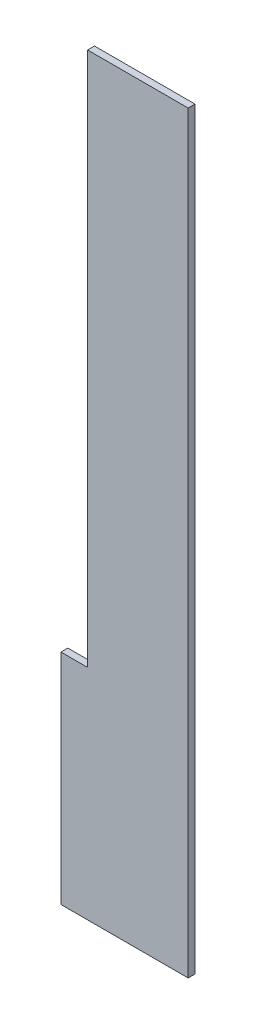
ISO-10303-21;
HEADER;
FILE_DESCRIPTION(('STEP AP214'),'2;1');
FILE_NAME('part.step','',(''),(''),'','','');
FILE_SCHEMA(('AUTOMOTIVE_DESIGN { 1 0 10303 214 1 1 1 1 }'));
ENDSEC;
DATA;
#1=APPLICATION_CONTEXT('core data for automotive mechanical design processes');
#2=APPLICATION_PROTOCOL_DEFINITION('international standard','automotive_design',2000,#1);
#3=PRODUCT_CONTEXT('',#1,'mechanical');
#4=PRODUCT('Part','Part','',(#3));
#5=PRODUCT_RELATED_PRODUCT_CATEGORY('part','',(#4));
#6=PRODUCT_DEFINITION_FORMATION('','',#4);
#7=PRODUCT_DEFINITION_CONTEXT('part definition',#1,'design');
#8=PRODUCT_DEFINITION('design','',#6,#7);
#9=PRODUCT_DEFINITION_SHAPE('','',#8);
#10=(LENGTH_UNIT() NAMED_UNIT(*) SI_UNIT(.MILLI.,.METRE.));
#11=(NAMED_UNIT(*) PLANE_ANGLE_UNIT() SI_UNIT($,.RADIAN.));
#12=(NAMED_UNIT(*) SI_UNIT($,.STERADIAN.) SOLID_ANGLE_UNIT());
#13=UNCERTAINTY_MEASURE_WITH_UNIT(LENGTH_MEASURE(1.E-05),#10,'distance_accuracy_value','');
#14=(GEOMETRIC_REPRESENTATION_CONTEXT(3) GLOBAL_UNCERTAINTY_ASSIGNED_CONTEXT((#13)) GLOBAL_UNIT_ASSIGNED_CONTEXT((#10,
#11,#12)) REPRESENTATION_CONTEXT('',''));
#15=CARTESIAN_POINT('',(0.,0.,0.));
#16=DIRECTION('',(0.,0.,1.));
#17=DIRECTION('',(1.,0.,0.));
#18=AXIS2_PLACEMENT_3D('',#15,#16,#17);
#19=CARTESIAN_POINT('',(4.24340115904558E-13,-3465.,-40.));
#20=DIRECTION('',(0.,1.,0.));
#21=DIRECTION('',(0.,0.,1.));
#22=AXIS2_PLACEMENT_3D('',#19,#20,#21);
#23=PLANE('',#22);
#24=DIRECTION('',(0.,0.,1.));
#25=VECTOR('',#24,1.);
#26=CARTESIAN_POINT('',(615.,-3465.,-40.));
#27=LINE('',#26,#25);
#28=CARTESIAN_POINT('',(615.,-3465.,-40.));
#29=VERTEX_POINT('',#28);
#30=CARTESIAN_POINT('',(615.,-3465.,0.));
#31=VERTEX_POINT('',#30);
#32=EDGE_CURVE('E96',#29,#31,#27,.T.);
#33=ORIENTED_EDGE('',*,*,#32,.T.);
#34=DIRECTION('',(-1.,0.,0.));
#35=VECTOR('',#34,1.);
#36=CARTESIAN_POINT('',(4.24340115904558E-13,-3465.,0.));
#37=LINE('',#36,#35);
#38=CARTESIAN_POINT('',(770.000000000001,-3465.,0.));
#39=VERTEX_POINT('',#38);
#40=EDGE_CURVE('E130',#39,#31,#37,.T.);
#41=ORIENTED_EDGE('',*,*,#40,.F.);
#42=DIRECTION('',(0.,0.,1.));
#43=VECTOR('',#42,1.);
#44=CARTESIAN_POINT('',(770.000000000001,-3465.,-40.));
#45=LINE('',#44,#43);
#46=CARTESIAN_POINT('',(770.000000000001,-3465.,-40.));
#47=VERTEX_POINT('',#46);
#48=EDGE_CURVE('E115',#47,#39,#45,.T.);
#49=ORIENTED_EDGE('',*,*,#48,.F.);
#50=DIRECTION('',(-1.,0.,0.));
#51=VECTOR('',#50,1.);
#52=CARTESIAN_POINT('',(4.24340115904558E-13,-3465.,-40.));
#53=LINE('',#52,#51);
#54=EDGE_CURVE('E131',#47,#29,#53,.T.);
#55=ORIENTED_EDGE('',*,*,#54,.T.);
#56=EDGE_LOOP('',(#33,#41,#49,#55));
#57=FACE_BOUND('',#56,.T.);
#58=ADVANCED_FACE('F38',(#57),#23,.T.);
#59=CARTESIAN_POINT('',(0.,0.,-40.));
#60=DIRECTION('',(0.,0.,1.));
#61=DIRECTION('',(1.,0.,0.));
#62=AXIS2_PLACEMENT_3D('',#59,#60,#61);
#63=PLANE('',#62);
#64=DIRECTION('',(-1.,0.,0.));
#65=VECTOR('',#64,1.);
#66=CARTESIAN_POINT('',(615.,-4737.,-40.));
#67=LINE('',#66,#65);
#68=CARTESIAN_POINT('',(1355.,-4737.,-40.));
#69=VERTEX_POINT('',#68);
#70=CARTESIAN_POINT('',(615.,-4737.,-40.));
#71=VERTEX_POINT('',#70);
#72=EDGE_CURVE('E52',#69,#71,#67,.T.);
#73=ORIENTED_EDGE('',*,*,#72,.T.);
#74=DIRECTION('',(0.,1.,0.));
#75=VECTOR('',#74,1.);
#76=CARTESIAN_POINT('',(615.,-3465.,-40.));
#77=LINE('',#76,#75);
#78=EDGE_CURVE('E100',#71,#29,#77,.T.);
#79=ORIENTED_EDGE('',*,*,#78,.T.);
#80=ORIENTED_EDGE('',*,*,#54,.F.);
#81=DIRECTION('',(0.,1.,0.));
#82=VECTOR('',#81,1.);
#83=CARTESIAN_POINT('',(770.,-355.,-40.));
#84=LINE('',#83,#82);
#85=CARTESIAN_POINT('',(770.,-355.,-40.));
#86=VERTEX_POINT('',#85);
#87=EDGE_CURVE('E112',#47,#86,#84,.T.);
#88=ORIENTED_EDGE('',*,*,#87,.T.);
#89=DIRECTION('',(1.,0.,0.));
#90=VECTOR('',#89,1.);
#91=CARTESIAN_POINT('',(0.,-355.,-40.));
#92=LINE('',#91,#90);
#93=CARTESIAN_POINT('',(1355.,-355.,-40.));
#94=VERTEX_POINT('',#93);
#95=EDGE_CURVE('E60',#86,#94,#92,.T.);
#96=ORIENTED_EDGE('',*,*,#95,.T.);
#97=DIRECTION('',(0.,-1.,0.));
#98=VECTOR('',#97,1.);
#99=CARTESIAN_POINT('',(1355.,-355.,-40.));
#100=LINE('',#99,#98);
#101=EDGE_CURVE('E106',#94,#69,#100,.T.);
#102=ORIENTED_EDGE('',*,*,#101,.T.);
#103=EDGE_LOOP('',(#73,#79,#80,#88,#96,#102));
#104=FACE_BOUND('',#103,.T.);
#105=ADVANCED_FACE('F105',(#104),#63,.F.);
#106=CARTESIAN_POINT('',(0.,0.,0.));
#107=DIRECTION('',(0.,0.,1.));
#108=DIRECTION('',(1.,0.,0.));
#109=AXIS2_PLACEMENT_3D('',#106,#107,#108);
#110=PLANE('',#109);
#111=DIRECTION('',(0.,1.,0.));
#112=VECTOR('',#111,1.);
#113=CARTESIAN_POINT('',(615.,0.,0.));
#114=LINE('',#113,#112);
#115=CARTESIAN_POINT('',(615.,-4737.,0.));
#116=VERTEX_POINT('',#115);
#117=EDGE_CURVE('E11',#116,#31,#114,.T.);
#118=ORIENTED_EDGE('',*,*,#117,.F.);
#119=DIRECTION('',(-1.,0.,0.));
#120=VECTOR('',#119,1.);
#121=CARTESIAN_POINT('',(0.,-4737.,0.));
#122=LINE('',#121,#120);
#123=CARTESIAN_POINT('',(1355.,-4737.,0.));
#124=VERTEX_POINT('',#123);
#125=EDGE_CURVE('E93',#124,#116,#122,.T.);
#126=ORIENTED_EDGE('',*,*,#125,.F.);
#127=DIRECTION('',(0.,-1.,0.));
#128=VECTOR('',#127,1.);
#129=CARTESIAN_POINT('',(1355.,2.13005621007729E-13,0.));
#130=LINE('',#129,#128);
#131=CARTESIAN_POINT('',(1355.,-355.,0.));
#132=VERTEX_POINT('',#131);
#133=EDGE_CURVE('E126',#132,#124,#130,.T.);
#134=ORIENTED_EDGE('',*,*,#133,.F.);
#135=DIRECTION('',(1.,0.,0.));
#136=VECTOR('',#135,1.);
#137=CARTESIAN_POINT('',(-1.15920345218215E-13,-355.,0.));
#138=LINE('',#137,#136);
#139=CARTESIAN_POINT('',(770.,-355.,0.));
#140=VERTEX_POINT('',#139);
#141=EDGE_CURVE('E45',#140,#132,#138,.T.);
#142=ORIENTED_EDGE('',*,*,#141,.F.);
#143=DIRECTION('',(0.,1.,0.));
#144=VECTOR('',#143,1.);
#145=CARTESIAN_POINT('',(770.,0.,0.));
#146=LINE('',#145,#144);
#147=EDGE_CURVE('E118',#39,#140,#146,.T.);
#148=ORIENTED_EDGE('',*,*,#147,.F.);
#149=ORIENTED_EDGE('',*,*,#40,.T.);
#150=EDGE_LOOP('',(#118,#126,#134,#142,#148,#149));
#151=FACE_BOUND('',#150,.T.);
#152=ADVANCED_FACE('F143',(#151),#110,.T.);
#153=CARTESIAN_POINT('',(0.,-355.,-40.));
#154=DIRECTION('',(0.,-1.,0.));
#155=DIRECTION('',(1.,0.,0.));
#156=AXIS2_PLACEMENT_3D('',#153,#154,#155);
#157=PLANE('',#156);
#158=ORIENTED_EDGE('',*,*,#95,.F.);
#159=DIRECTION('',(0.,0.,1.));
#160=VECTOR('',#159,1.);
#161=CARTESIAN_POINT('',(770.,-355.,-40.));
#162=LINE('',#161,#160);
#163=EDGE_CURVE('E114',#86,#140,#162,.T.);
#164=ORIENTED_EDGE('',*,*,#163,.T.);
#165=ORIENTED_EDGE('',*,*,#141,.T.);
#166=DIRECTION('',(0.,0.,1.));
#167=VECTOR('',#166,1.);
#168=CARTESIAN_POINT('',(1355.,-355.,-40.));
#169=LINE('',#168,#167);
#170=EDGE_CURVE('E123',#94,#132,#169,.T.);
#171=ORIENTED_EDGE('',*,*,#170,.F.);
#172=EDGE_LOOP('',(#158,#164,#165,#171));
#173=FACE_BOUND('',#172,.T.);
#174=ADVANCED_FACE('F137',(#173),#157,.F.);
#175=CARTESIAN_POINT('',(1355.,-355.,-40.));
#176=DIRECTION('',(-1.,0.,0.));
#177=DIRECTION('',(0.,-1.,0.));
#178=AXIS2_PLACEMENT_3D('',#175,#176,#177);
#179=PLANE('',#178);
#180=ORIENTED_EDGE('',*,*,#133,.T.);
#181=DIRECTION('',(0.,0.,1.));
#182=VECTOR('',#181,1.);
#183=CARTESIAN_POINT('',(1355.,-4737.,-40.));
#184=LINE('',#183,#182);
#185=EDGE_CURVE('E97',#69,#124,#184,.T.);
#186=ORIENTED_EDGE('',*,*,#185,.F.);
#187=ORIENTED_EDGE('',*,*,#101,.F.);
#188=ORIENTED_EDGE('',*,*,#170,.T.);
#189=EDGE_LOOP('',(#180,#186,#187,#188));
#190=FACE_BOUND('',#189,.T.);
#191=ADVANCED_FACE('F142',(#190),#179,.F.);
#192=CARTESIAN_POINT('',(770.,-355.,-40.));
#193=DIRECTION('',(1.,0.,0.));
#194=DIRECTION('',(0.,1.,0.));
#195=AXIS2_PLACEMENT_3D('',#192,#193,#194);
#196=PLANE('',#195);
#197=ORIENTED_EDGE('',*,*,#147,.T.);
#198=ORIENTED_EDGE('',*,*,#163,.F.);
#199=ORIENTED_EDGE('',*,*,#87,.F.);
#200=ORIENTED_EDGE('',*,*,#48,.T.);
#201=EDGE_LOOP('',(#197,#198,#199,#200));
#202=FACE_BOUND('',#201,.T.);
#203=ADVANCED_FACE('F148',(#202),#196,.F.);
#204=CARTESIAN_POINT('',(615.,-3465.,-40.));
#205=DIRECTION('',(1.,0.,0.));
#206=DIRECTION('',(0.,1.,0.));
#207=AXIS2_PLACEMENT_3D('',#204,#205,#206);
#208=PLANE('',#207);
#209=ORIENTED_EDGE('',*,*,#117,.T.);
#210=ORIENTED_EDGE('',*,*,#32,.F.);
#211=ORIENTED_EDGE('',*,*,#78,.F.);
#212=DIRECTION('',(0.,0.,1.));
#213=VECTOR('',#212,1.);
#214=CARTESIAN_POINT('',(615.,-4737.,-40.));
#215=LINE('',#214,#213);
#216=EDGE_CURVE('E89',#71,#116,#215,.T.);
#217=ORIENTED_EDGE('',*,*,#216,.T.);
#218=EDGE_LOOP('',(#209,#210,#211,#217));
#219=FACE_BOUND('',#218,.T.);
#220=ADVANCED_FACE('F101',(#219),#208,.F.);
#221=CARTESIAN_POINT('',(615.,-4737.,-40.));
#222=DIRECTION('',(0.,1.,0.));
#223=DIRECTION('',(0.,0.,1.));
#224=AXIS2_PLACEMENT_3D('',#221,#222,#223);
#225=PLANE('',#224);
#226=ORIENTED_EDGE('',*,*,#125,.T.);
#227=ORIENTED_EDGE('',*,*,#216,.F.);
#228=ORIENTED_EDGE('',*,*,#72,.F.);
#229=ORIENTED_EDGE('',*,*,#185,.T.);
#230=EDGE_LOOP('',(#226,#227,#228,#229));
#231=FACE_BOUND('',#230,.T.);
#232=ADVANCED_FACE('F91',(#231),#225,.F.);
#233=CLOSED_SHELL('',(#58,#105,#152,#174,#191,#203,#220,#232));
#234=MANIFOLD_SOLID_BREP('B2',#233);
#235=ADVANCED_BREP_SHAPE_REPRESENTATION('',(#18,#234),#14);
#236=SHAPE_DEFINITION_REPRESENTATION(#9,#235);
ENDSEC;
END-ISO-10303-21;
